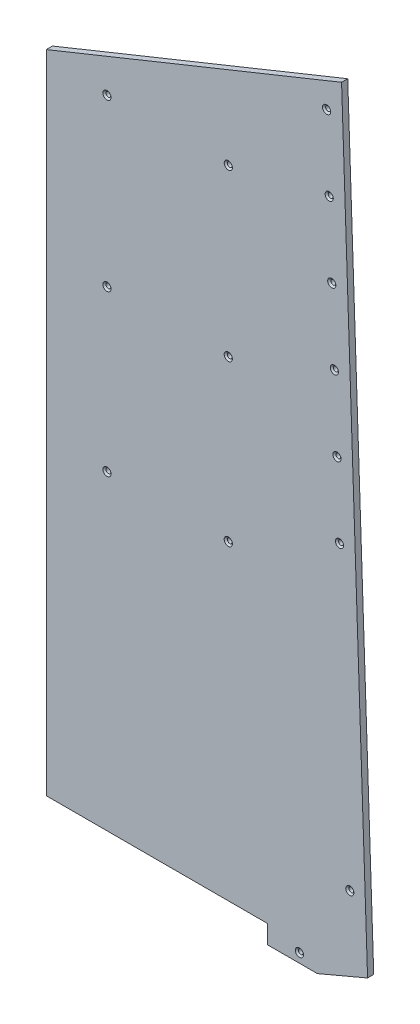
ISO-10303-21;
HEADER;
FILE_DESCRIPTION(('STEP AP214'),'2;1');
FILE_NAME('part.step','',(''),(''),'','','');
FILE_SCHEMA(('AUTOMOTIVE_DESIGN { 1 0 10303 214 1 1 1 1 }'));
ENDSEC;
DATA;
#1=APPLICATION_CONTEXT('core data for automotive mechanical design processes');
#2=APPLICATION_PROTOCOL_DEFINITION('international standard','automotive_design',2000,#1);
#3=PRODUCT_CONTEXT('',#1,'mechanical');
#4=PRODUCT('Part','Part','',(#3));
#5=PRODUCT_RELATED_PRODUCT_CATEGORY('part','',(#4));
#6=PRODUCT_DEFINITION_FORMATION('','',#4);
#7=PRODUCT_DEFINITION_CONTEXT('part definition',#1,'design');
#8=PRODUCT_DEFINITION('design','',#6,#7);
#9=PRODUCT_DEFINITION_SHAPE('','',#8);
#10=(LENGTH_UNIT() NAMED_UNIT(*) SI_UNIT(.MILLI.,.METRE.));
#11=(NAMED_UNIT(*) PLANE_ANGLE_UNIT() SI_UNIT($,.RADIAN.));
#12=(NAMED_UNIT(*) SI_UNIT($,.STERADIAN.) SOLID_ANGLE_UNIT());
#13=UNCERTAINTY_MEASURE_WITH_UNIT(LENGTH_MEASURE(1.E-05),#10,'distance_accuracy_value','');
#14=(GEOMETRIC_REPRESENTATION_CONTEXT(3) GLOBAL_UNCERTAINTY_ASSIGNED_CONTEXT((#13)) GLOBAL_UNIT_ASSIGNED_CONTEXT((#10,
#11,#12)) REPRESENTATION_CONTEXT('',''));
#15=CARTESIAN_POINT('',(0.,0.,0.));
#16=DIRECTION('',(0.,0.,1.));
#17=DIRECTION('',(1.,0.,0.));
#18=AXIS2_PLACEMENT_3D('',#15,#16,#17);
#19=CARTESIAN_POINT('',(0.,5955.03000000001,6.35));
#20=DIRECTION('',(0.,-1.,0.));
#21=DIRECTION('',(0.,0.,-1.));
#22=AXIS2_PLACEMENT_3D('',#19,#20,#21);
#23=PLANE('',#22);
#24=DIRECTION('',(-1.,0.,0.));
#25=VECTOR('',#24,1.);
#26=CARTESIAN_POINT('',(0.,5955.03000000001,0.));
#27=LINE('',#26,#25);
#28=CARTESIAN_POINT('',(2911.73000206494,5955.03000000001,0.));
#29=VERTEX_POINT('',#28);
#30=CARTESIAN_POINT('',(2683.51000001261,5955.03000000001,0.));
#31=VERTEX_POINT('',#30);
#32=EDGE_CURVE('E132',#29,#31,#27,.T.);
#33=ORIENTED_EDGE('',*,*,#32,.F.);
#34=DIRECTION('',(0.,0.,-1.));
#35=VECTOR('',#34,1.);
#36=CARTESIAN_POINT('',(2911.73000206494,5955.03000000001,6.35));
#37=LINE('',#36,#35);
#38=CARTESIAN_POINT('',(2911.73000206494,5955.03000000001,6.35));
#39=VERTEX_POINT('',#38);
#40=EDGE_CURVE('E11',#39,#29,#37,.T.);
#41=ORIENTED_EDGE('',*,*,#40,.F.);
#42=DIRECTION('',(-1.,0.,0.));
#43=VECTOR('',#42,1.);
#44=CARTESIAN_POINT('',(0.,5955.03000000001,6.35));
#45=LINE('',#44,#43);
#46=CARTESIAN_POINT('',(2683.51000001261,5955.03000000001,6.35));
#47=VERTEX_POINT('',#46);
#48=EDGE_CURVE('E150',#39,#47,#45,.T.);
#49=ORIENTED_EDGE('',*,*,#48,.T.);
#50=DIRECTION('',(0.,0.,-1.));
#51=VECTOR('',#50,1.);
#52=CARTESIAN_POINT('',(2683.51000001261,5955.03000000001,6.35));
#53=LINE('',#52,#51);
#54=EDGE_CURVE('E86',#47,#31,#53,.T.);
#55=ORIENTED_EDGE('',*,*,#54,.T.);
#56=EDGE_LOOP('',(#33,#41,#49,#55));
#57=FACE_BOUND('',#56,.T.);
#58=ADVANCED_FACE('F40',(#57),#23,.T.);
#59=CARTESIAN_POINT('',(2911.73000206494,0.,6.35));
#60=DIRECTION('',(1.,0.,0.));
#61=DIRECTION('',(0.,0.,-1.));
#62=AXIS2_PLACEMENT_3D('',#59,#60,#61);
#63=PLANE('',#62);
#64=DIRECTION('',(0.,-1.,0.));
#65=VECTOR('',#64,1.);
#66=CARTESIAN_POINT('',(2911.73000206494,0.,0.));
#67=LINE('',#66,#65);
#68=CARTESIAN_POINT('',(2911.73000206494,5935.98000018255,0.));
#69=VERTEX_POINT('',#68);
#70=EDGE_CURVE('E135',#29,#69,#67,.T.);
#71=ORIENTED_EDGE('',*,*,#70,.T.);
#72=DIRECTION('',(0.,0.,-1.));
#73=VECTOR('',#72,1.);
#74=CARTESIAN_POINT('',(2911.73000206494,5935.98000018255,6.35));
#75=LINE('',#74,#73);
#76=CARTESIAN_POINT('',(2911.73000206494,5935.98000018255,6.35));
#77=VERTEX_POINT('',#76);
#78=EDGE_CURVE('E48',#77,#69,#75,.T.);
#79=ORIENTED_EDGE('',*,*,#78,.F.);
#80=DIRECTION('',(0.,-1.,0.));
#81=VECTOR('',#80,1.);
#82=CARTESIAN_POINT('',(2911.73000206494,0.,6.35));
#83=LINE('',#82,#81);
#84=EDGE_CURVE('E186',#39,#77,#83,.T.);
#85=ORIENTED_EDGE('',*,*,#84,.F.);
#86=ORIENTED_EDGE('',*,*,#40,.T.);
#87=EDGE_LOOP('',(#71,#79,#85,#86));
#88=FACE_BOUND('',#87,.T.);
#89=ADVANCED_FACE('F162',(#88),#63,.F.);
#90=CARTESIAN_POINT('',(0.,5935.98000018255,6.35));
#91=DIRECTION('',(0.,-1.,0.));
#92=DIRECTION('',(0.,0.,-1.));
#93=AXIS2_PLACEMENT_3D('',#90,#91,#92);
#94=PLANE('',#93);
#95=DIRECTION('',(-1.,0.,0.));
#96=VECTOR('',#95,1.);
#97=CARTESIAN_POINT('',(0.,5935.98000018255,0.));
#98=LINE('',#97,#96);
#99=CARTESIAN_POINT('',(2962.99865857176,5935.98000018255,0.));
#100=VERTEX_POINT('',#99);
#101=EDGE_CURVE('E139',#100,#69,#98,.T.);
#102=ORIENTED_EDGE('',*,*,#101,.F.);
#103=DIRECTION('',(0.,0.,-1.));
#104=VECTOR('',#103,1.);
#105=CARTESIAN_POINT('',(2962.99865857176,5935.98000018255,6.35));
#106=LINE('',#105,#104);
#107=CARTESIAN_POINT('',(2962.99865857176,5935.98000018255,6.35));
#108=VERTEX_POINT('',#107);
#109=EDGE_CURVE('E113',#108,#100,#106,.T.);
#110=ORIENTED_EDGE('',*,*,#109,.F.);
#111=DIRECTION('',(-1.,0.,0.));
#112=VECTOR('',#111,1.);
#113=CARTESIAN_POINT('',(0.,5935.98000018255,6.35));
#114=LINE('',#113,#112);
#115=EDGE_CURVE('E121',#108,#77,#114,.T.);
#116=ORIENTED_EDGE('',*,*,#115,.T.);
#117=ORIENTED_EDGE('',*,*,#78,.T.);
#118=EDGE_LOOP('',(#102,#110,#116,#117));
#119=FACE_BOUND('',#118,.T.);
#120=ADVANCED_FACE('F159',(#119),#94,.T.);
#121=CARTESIAN_POINT('',(-1682.62991470468,3964.02766536305,6.35));
#122=DIRECTION('',(0.390731128489256,-0.920504853452448,0.));
#123=DIRECTION('',(0.920504853452448,0.390731128489256,0.));
#124=AXIS2_PLACEMENT_3D('',#121,#122,#123);
#125=PLANE('',#124);
#126=DIRECTION('',(-0.920504853452448,-0.390731128489256,0.));
#127=VECTOR('',#126,1.);
#128=CARTESIAN_POINT('',(-1682.62991470468,3964.02766536305,0.));
#129=LINE('',#128,#127);
#130=CARTESIAN_POINT('',(3014.72880420686,5957.9381442435,0.));
#131=VERTEX_POINT('',#130);
#132=EDGE_CURVE('E109',#131,#100,#129,.T.);
#133=ORIENTED_EDGE('',*,*,#132,.F.);
#134=DIRECTION('',(0.,0.,-1.));
#135=VECTOR('',#134,1.);
#136=CARTESIAN_POINT('',(3014.72880420686,5957.9381442435,6.35));
#137=LINE('',#136,#135);
#138=CARTESIAN_POINT('',(3014.72880420686,5957.9381442435,6.35));
#139=VERTEX_POINT('',#138);
#140=EDGE_CURVE('E104',#139,#131,#137,.T.);
#141=ORIENTED_EDGE('',*,*,#140,.F.);
#142=DIRECTION('',(-0.920504853452448,-0.390731128489256,0.));
#143=VECTOR('',#142,1.);
#144=CARTESIAN_POINT('',(-1682.62991470468,3964.02766536305,6.35));
#145=LINE('',#144,#143);
#146=EDGE_CURVE('E107',#139,#108,#145,.T.);
#147=ORIENTED_EDGE('',*,*,#146,.T.);
#148=ORIENTED_EDGE('',*,*,#109,.T.);
#149=EDGE_LOOP('',(#133,#141,#147,#148));
#150=FACE_BOUND('',#149,.T.);
#151=ADVANCED_FACE('F106',(#150),#125,.T.);
#152=CARTESIAN_POINT('',(3214.06687360478,109.549122522575,6.35));
#153=DIRECTION('',(0.999419636898833,0.0340644885622129,0.));
#154=DIRECTION('',(-0.0340644885622129,0.999419636898833,0.));
#155=AXIS2_PLACEMENT_3D('',#152,#153,#154);
#156=PLANE('',#155);
#157=DIRECTION('',(0.0340644885622129,-0.999419636898833,0.));
#158=VECTOR('',#157,1.);
#159=CARTESIAN_POINT('',(3214.06687360478,109.549122522575,0.));
#160=LINE('',#159,#158);
#161=CARTESIAN_POINT('',(2987.93000206494,6744.1894645031,0.));
#162=VERTEX_POINT('',#161);
#163=EDGE_CURVE('E143',#162,#131,#160,.T.);
#164=ORIENTED_EDGE('',*,*,#163,.F.);
#165=DIRECTION('',(0.,0.,-1.));
#166=VECTOR('',#165,1.);
#167=CARTESIAN_POINT('',(2987.93000206494,6744.1894645031,6.35));
#168=LINE('',#167,#166);
#169=CARTESIAN_POINT('',(2987.93000206494,6744.1894645031,6.35));
#170=VERTEX_POINT('',#169);
#171=EDGE_CURVE('E79',#170,#162,#168,.T.);
#172=ORIENTED_EDGE('',*,*,#171,.F.);
#173=DIRECTION('',(0.0340644885622129,-0.999419636898833,0.));
#174=VECTOR('',#173,1.);
#175=CARTESIAN_POINT('',(3214.06687360478,109.549122522575,6.35));
#176=LINE('',#175,#174);
#177=EDGE_CURVE('E119',#170,#139,#176,.T.);
#178=ORIENTED_EDGE('',*,*,#177,.T.);
#179=ORIENTED_EDGE('',*,*,#140,.T.);
#180=EDGE_LOOP('',(#164,#172,#178,#179));
#181=FACE_BOUND('',#180,.T.);
#182=ADVANCED_FACE('F123',(#181),#156,.T.);
#183=CARTESIAN_POINT('',(-1923.15731629717,4759.98139044679,6.35));
#184=DIRECTION('',(-0.374606593427528,0.927183854562094,0.));
#185=DIRECTION('',(-0.927183854562095,-0.374606593427528,0.));
#186=AXIS2_PLACEMENT_3D('',#183,#184,#185);
#187=PLANE('',#186);
#188=DIRECTION('',(0.927183854562094,0.374606593427528,0.));
#189=VECTOR('',#188,1.);
#190=CARTESIAN_POINT('',(-1923.15731629717,4759.98139044679,0.));
#191=LINE('',#190,#189);
#192=CARTESIAN_POINT('',(2683.51000001082,6621.19580000001,0.));
#193=VERTEX_POINT('',#192);
#194=EDGE_CURVE('E145',#193,#162,#191,.T.);
#195=ORIENTED_EDGE('',*,*,#194,.F.);
#196=DIRECTION('',(0.,0.,-1.));
#197=VECTOR('',#196,1.);
#198=CARTESIAN_POINT('',(2683.51000001082,6621.19580000001,6.35));
#199=LINE('',#198,#197);
#200=CARTESIAN_POINT('',(2683.51000001082,6621.19580000001,6.35));
#201=VERTEX_POINT('',#200);
#202=EDGE_CURVE('E152',#201,#193,#199,.T.);
#203=ORIENTED_EDGE('',*,*,#202,.F.);
#204=DIRECTION('',(0.927183854562094,0.374606593427528,0.));
#205=VECTOR('',#204,1.);
#206=CARTESIAN_POINT('',(-1923.15731629717,4759.98139044679,6.35));
#207=LINE('',#206,#205);
#208=EDGE_CURVE('E125',#201,#170,#207,.T.);
#209=ORIENTED_EDGE('',*,*,#208,.T.);
#210=ORIENTED_EDGE('',*,*,#171,.T.);
#211=EDGE_LOOP('',(#195,#203,#209,#210));
#212=FACE_BOUND('',#211,.T.);
#213=ADVANCED_FACE('F169',(#212),#187,.T.);
#214=CARTESIAN_POINT('',(2683.51000002859,7.20219501792756E-09,6.35));
#215=DIRECTION('',(1.,2.683871130665E-12,0.));
#216=DIRECTION('',(-2.683871130665E-12,1.,0.));
#217=AXIS2_PLACEMENT_3D('',#214,#215,#216);
#218=PLANE('',#217);
#219=DIRECTION('',(2.683871130665E-12,-1.,0.));
#220=VECTOR('',#219,1.);
#221=CARTESIAN_POINT('',(2683.51000002859,7.20219501792756E-09,0.));
#222=LINE('',#221,#220);
#223=CARTESIAN_POINT('',(2683.51000038598,6602.14580000002,0.));
#224=VERTEX_POINT('',#223);
#225=EDGE_CURVE('E148',#224,#31,#222,.T.);
#226=ORIENTED_EDGE('',*,*,#225,.T.);
#227=ORIENTED_EDGE('',*,*,#54,.F.);
#228=DIRECTION('',(2.683871130665E-12,-1.,0.));
#229=VECTOR('',#228,1.);
#230=CARTESIAN_POINT('',(2683.51000002859,7.20219501792756E-09,6.35));
#231=LINE('',#230,#229);
#232=CARTESIAN_POINT('',(2683.51000038598,6602.14580000002,6.35));
#233=VERTEX_POINT('',#232);
#234=EDGE_CURVE('E56',#233,#47,#231,.T.);
#235=ORIENTED_EDGE('',*,*,#234,.F.);
#236=DIRECTION('',(1.969333998879E-08,-1.,0.));
#237=VECTOR('',#236,1.);
#238=CARTESIAN_POINT('',(2683.51000001082,6621.19580000001,6.35));
#239=LINE('',#238,#237);
#240=EDGE_CURVE('E176',#201,#233,#239,.T.);
#241=ORIENTED_EDGE('',*,*,#240,.F.);
#242=ORIENTED_EDGE('',*,*,#202,.T.);
#243=DIRECTION('',(-1.96933399887901E-08,1.,0.));
#244=VECTOR('',#243,1.);
#245=CARTESIAN_POINT('',(2683.51000001082,6621.19580000001,0.));
#246=LINE('',#245,#244);
#247=EDGE_CURVE('E136',#224,#193,#246,.T.);
#248=ORIENTED_EDGE('',*,*,#247,.F.);
#249=EDGE_LOOP('',(#226,#227,#235,#241,#242,#248));
#250=FACE_BOUND('',#249,.T.);
#251=ADVANCED_FACE('F177',(#250),#218,.F.);
#252=CARTESIAN_POINT('',(0.,0.,6.35));
#253=DIRECTION('',(0.,0.,1.));
#254=DIRECTION('',(1.,0.,0.));
#255=AXIS2_PLACEMENT_3D('',#252,#253,#254);
#256=PLANE('',#255);
#257=CARTESIAN_POINT('',(2871.15080465522,6611.67080000002,6.35));
#258=DIRECTION('',(0.,0.,1.));
#259=DIRECTION('',(1.,0.,0.));
#260=AXIS2_PLACEMENT_3D('',#257,#258,#259);
#261=CIRCLE('',#260,4.21639999999979);
#262=CARTESIAN_POINT('',(2875.36720465522,6611.67080000002,6.35));
#263=VERTEX_POINT('',#262);
#264=EDGE_CURVE('E329',#263,#263,#261,.T.);
#265=ORIENTED_EDGE('',*,*,#264,.F.);
#266=EDGE_LOOP('',(#265));
#267=FACE_BOUND('',#266,.T.);
#268=CARTESIAN_POINT('',(2746.05693505903,6611.67080000002,6.35));
#269=DIRECTION('',(0.,0.,1.));
#270=DIRECTION('',(1.,0.,0.));
#271=AXIS2_PLACEMENT_3D('',#268,#269,#270);
#272=CIRCLE('',#271,4.21639999999979);
#273=CARTESIAN_POINT('',(2750.27333505903,6611.67080000002,6.35));
#274=VERTEX_POINT('',#273);
#275=EDGE_CURVE('E336',#274,#274,#272,.T.);
#276=ORIENTED_EDGE('',*,*,#275,.F.);
#277=EDGE_LOOP('',(#276));
#278=FACE_BOUND('',#277,.T.);
#279=CARTESIAN_POINT('',(2746.05693486333,6440.80500000001,6.35));
#280=DIRECTION('',(0.,0.,1.));
#281=DIRECTION('',(1.,0.,0.));
#282=AXIS2_PLACEMENT_3D('',#279,#280,#281);
#283=CIRCLE('',#282,4.21639999999979);
#284=CARTESIAN_POINT('',(2750.27333486333,6440.80500000001,6.35));
#285=VERTEX_POINT('',#284);
#286=EDGE_CURVE('E345',#285,#285,#283,.T.);
#287=ORIENTED_EDGE('',*,*,#286,.F.);
#288=EDGE_LOOP('',(#287));
#289=FACE_BOUND('',#288,.T.);
#290=CARTESIAN_POINT('',(2871.15080458999,6440.80500000001,6.35));
#291=DIRECTION('',(0.,0.,1.));
#292=DIRECTION('',(1.,0.,0.));
#293=AXIS2_PLACEMENT_3D('',#290,#291,#292);
#294=CIRCLE('',#293,4.21639999999979);
#295=CARTESIAN_POINT('',(2875.36720458999,6440.80500000001,6.35));
#296=VERTEX_POINT('',#295);
#297=EDGE_CURVE('E354',#296,#296,#294,.T.);
#298=ORIENTED_EDGE('',*,*,#297,.F.);
#299=EDGE_LOOP('',(#298));
#300=FACE_BOUND('',#299,.T.);
#301=CARTESIAN_POINT('',(2746.05693510027,6275.70500021418,6.35));
#302=DIRECTION('',(0.,0.,1.));
#303=DIRECTION('',(1.,0.,0.));
#304=AXIS2_PLACEMENT_3D('',#301,#302,#303);
#305=CIRCLE('',#304,4.21639999999979);
#306=CARTESIAN_POINT('',(2750.27333510027,6275.70500021418,6.35));
#307=VERTEX_POINT('',#306);
#308=EDGE_CURVE('E363',#307,#307,#305,.T.);
#309=ORIENTED_EDGE('',*,*,#308,.F.);
#310=EDGE_LOOP('',(#309));
#311=FACE_BOUND('',#310,.T.);
#312=CARTESIAN_POINT('',(2871.15080476319,6275.70500021417,6.35));
#313=DIRECTION('',(0.,0.,1.));
#314=DIRECTION('',(1.,0.,0.));
#315=AXIS2_PLACEMENT_3D('',#312,#313,#314);
#316=CIRCLE('',#315,4.21639999999979);
#317=CARTESIAN_POINT('',(2875.36720476319,6275.70500021417,6.35));
#318=VERTEX_POINT('',#317);
#319=EDGE_CURVE('E372',#318,#318,#316,.T.);
#320=ORIENTED_EDGE('',*,*,#319,.F.);
#321=EDGE_LOOP('',(#320));
#322=FACE_BOUND('',#321,.T.);
#323=CARTESIAN_POINT('',(2944.44621429083,5945.50500055575,6.35));
#324=DIRECTION('',(0.,0.,1.));
#325=DIRECTION('',(1.,0.,0.));
#326=AXIS2_PLACEMENT_3D('',#323,#324,#325);
#327=CIRCLE('',#326,4.21639999999979);
#328=CARTESIAN_POINT('',(2948.66261429083,5945.50500055575,6.35));
#329=VERTEX_POINT('',#328);
#330=EDGE_CURVE('E381',#329,#329,#327,.T.);
#331=ORIENTED_EDGE('',*,*,#330,.F.);
#332=EDGE_LOOP('',(#331));
#333=FACE_BOUND('',#332,.T.);
#334=CARTESIAN_POINT('',(2996.43958807611,6026.79520735138,6.35));
#335=DIRECTION('',(0.,0.,1.));
#336=DIRECTION('',(1.,0.,0.));
#337=AXIS2_PLACEMENT_3D('',#334,#335,#336);
#338=CIRCLE('',#337,4.21639999999979);
#339=CARTESIAN_POINT('',(3000.65598807611,6026.79520735138,6.35));
#340=VERTEX_POINT('',#339);
#341=EDGE_CURVE('E390',#340,#340,#338,.T.);
#342=ORIENTED_EDGE('',*,*,#341,.F.);
#343=EDGE_LOOP('',(#342));
#344=FACE_BOUND('',#343,.T.);
#345=CARTESIAN_POINT('',(2985.80222148104,6331.4095314268,6.35));
#346=DIRECTION('',(0.,0.,1.));
#347=DIRECTION('',(1.,0.,0.));
#348=AXIS2_PLACEMENT_3D('',#345,#346,#347);
#349=CIRCLE('',#348,4.21639999999979);
#350=CARTESIAN_POINT('',(2990.01862148104,6331.4095314268,6.35));
#351=VERTEX_POINT('',#350);
#352=EDGE_CURVE('E399',#351,#351,#349,.T.);
#353=ORIENTED_EDGE('',*,*,#352,.F.);
#354=EDGE_LOOP('',(#353));
#355=FACE_BOUND('',#354,.T.);
#356=CARTESIAN_POINT('',(2983.14287983227,6407.56311244565,6.35));
#357=DIRECTION('',(0.,0.,1.));
#358=DIRECTION('',(1.,0.,0.));
#359=AXIS2_PLACEMENT_3D('',#356,#357,#358);
#360=CIRCLE('',#359,4.21639999999979);
#361=CARTESIAN_POINT('',(2987.35927983227,6407.56311244565,6.35));
#362=VERTEX_POINT('',#361);
#363=EDGE_CURVE('E408',#362,#362,#360,.T.);
#364=ORIENTED_EDGE('',*,*,#363,.F.);
#365=EDGE_LOOP('',(#364));
#366=FACE_BOUND('',#365,.T.);
#367=CARTESIAN_POINT('',(2980.4835381835,6483.7166934645,6.35));
#368=DIRECTION('',(0.,0.,1.));
#369=DIRECTION('',(1.,0.,0.));
#370=AXIS2_PLACEMENT_3D('',#367,#368,#369);
#371=CIRCLE('',#370,4.21639999999979);
#372=CARTESIAN_POINT('',(2984.6999381835,6483.7166934645,6.35));
#373=VERTEX_POINT('',#372);
#374=EDGE_CURVE('E417',#373,#373,#371,.T.);
#375=ORIENTED_EDGE('',*,*,#374,.F.);
#376=EDGE_LOOP('',(#375));
#377=FACE_BOUND('',#376,.T.);
#378=CARTESIAN_POINT('',(2977.82419653474,6559.87027448336,6.35));
#379=DIRECTION('',(0.,0.,1.));
#380=DIRECTION('',(1.,0.,0.));
#381=AXIS2_PLACEMENT_3D('',#378,#379,#380);
#382=CIRCLE('',#381,4.21639999999979);
#383=CARTESIAN_POINT('',(2982.04059653473,6559.87027448336,6.35));
#384=VERTEX_POINT('',#383);
#385=EDGE_CURVE('E426',#384,#384,#382,.T.);
#386=ORIENTED_EDGE('',*,*,#385,.F.);
#387=EDGE_LOOP('',(#386));
#388=FACE_BOUND('',#387,.T.);
#389=CARTESIAN_POINT('',(2975.16485488597,6636.02385550221,6.35));
#390=DIRECTION('',(0.,0.,1.));
#391=DIRECTION('',(1.,0.,0.));
#392=AXIS2_PLACEMENT_3D('',#389,#390,#391);
#393=CIRCLE('',#392,4.21639999999979);
#394=CARTESIAN_POINT('',(2979.38125488597,6636.02385550221,6.35));
#395=VERTEX_POINT('',#394);
#396=EDGE_CURVE('E435',#395,#395,#393,.T.);
#397=ORIENTED_EDGE('',*,*,#396,.F.);
#398=EDGE_LOOP('',(#397));
#399=FACE_BOUND('',#398,.T.);
#400=CARTESIAN_POINT('',(2972.5055132372,6712.17743652106,6.35));
#401=DIRECTION('',(0.,0.,1.));
#402=DIRECTION('',(1.,0.,0.));
#403=AXIS2_PLACEMENT_3D('',#400,#401,#402);
#404=CIRCLE('',#403,4.21639999999979);
#405=CARTESIAN_POINT('',(2976.7219132372,6712.17743652106,6.35));
#406=VERTEX_POINT('',#405);
#407=EDGE_CURVE('E444',#406,#406,#404,.T.);
#408=ORIENTED_EDGE('',*,*,#407,.F.);
#409=EDGE_LOOP('',(#408));
#410=FACE_BOUND('',#409,.T.);
#411=ORIENTED_EDGE('',*,*,#208,.F.);
#412=ORIENTED_EDGE('',*,*,#240,.T.);
#413=ORIENTED_EDGE('',*,*,#234,.T.);
#414=ORIENTED_EDGE('',*,*,#48,.F.);
#415=ORIENTED_EDGE('',*,*,#84,.T.);
#416=ORIENTED_EDGE('',*,*,#115,.F.);
#417=ORIENTED_EDGE('',*,*,#146,.F.);
#418=ORIENTED_EDGE('',*,*,#177,.F.);
#419=EDGE_LOOP('',(#411,#412,#413,#414,#415,#416,#417,#418));
#420=FACE_BOUND('',#419,.T.);
#421=ADVANCED_FACE('F118',(#267,#278,#289,#300,#311,#322,#333,#344,#355,#366,#377,#388,#399,
#410,#420),#256,.T.);
#422=CARTESIAN_POINT('',(0.,0.,0.));
#423=DIRECTION('',(0.,0.,1.));
#424=DIRECTION('',(1.,0.,0.));
#425=AXIS2_PLACEMENT_3D('',#422,#423,#424);
#426=PLANE('',#425);
#427=CARTESIAN_POINT('',(2871.15080465522,6611.67080000002,0.));
#428=DIRECTION('',(0.,0.,1.));
#429=DIRECTION('',(1.,0.,0.));
#430=AXIS2_PLACEMENT_3D('',#427,#428,#429);
#431=CIRCLE('',#430,2.45745000000008);
#432=CARTESIAN_POINT('',(2873.60825465522,6611.67080000002,0.));
#433=VERTEX_POINT('',#432);
#434=EDGE_CURVE('E331',#433,#433,#431,.T.);
#435=ORIENTED_EDGE('',*,*,#434,.T.);
#436=EDGE_LOOP('',(#435));
#437=FACE_BOUND('',#436,.T.);
#438=CARTESIAN_POINT('',(2746.05693505903,6611.67080000002,0.));
#439=DIRECTION('',(0.,0.,1.));
#440=DIRECTION('',(1.,0.,0.));
#441=AXIS2_PLACEMENT_3D('',#438,#439,#440);
#442=CIRCLE('',#441,2.45745000000008);
#443=CARTESIAN_POINT('',(2748.51438505903,6611.67080000002,0.));
#444=VERTEX_POINT('',#443);
#445=EDGE_CURVE('E342',#444,#444,#442,.T.);
#446=ORIENTED_EDGE('',*,*,#445,.T.);
#447=EDGE_LOOP('',(#446));
#448=FACE_BOUND('',#447,.T.);
#449=CARTESIAN_POINT('',(2746.05693486333,6440.80500000001,0.));
#450=DIRECTION('',(0.,0.,1.));
#451=DIRECTION('',(1.,0.,0.));
#452=AXIS2_PLACEMENT_3D('',#449,#450,#451);
#453=CIRCLE('',#452,2.45745000000008);
#454=CARTESIAN_POINT('',(2748.51438486333,6440.80500000001,0.));
#455=VERTEX_POINT('',#454);
#456=EDGE_CURVE('E351',#455,#455,#453,.T.);
#457=ORIENTED_EDGE('',*,*,#456,.T.);
#458=EDGE_LOOP('',(#457));
#459=FACE_BOUND('',#458,.T.);
#460=CARTESIAN_POINT('',(2871.15080458999,6440.80500000001,0.));
#461=DIRECTION('',(0.,0.,1.));
#462=DIRECTION('',(1.,0.,0.));
#463=AXIS2_PLACEMENT_3D('',#460,#461,#462);
#464=CIRCLE('',#463,2.45745000000008);
#465=CARTESIAN_POINT('',(2873.60825458999,6440.80500000001,0.));
#466=VERTEX_POINT('',#465);
#467=EDGE_CURVE('E360',#466,#466,#464,.T.);
#468=ORIENTED_EDGE('',*,*,#467,.T.);
#469=EDGE_LOOP('',(#468));
#470=FACE_BOUND('',#469,.T.);
#471=CARTESIAN_POINT('',(2746.05693510027,6275.70500021418,0.));
#472=DIRECTION('',(0.,0.,1.));
#473=DIRECTION('',(1.,0.,0.));
#474=AXIS2_PLACEMENT_3D('',#471,#472,#473);
#475=CIRCLE('',#474,2.45745000000008);
#476=CARTESIAN_POINT('',(2748.51438510027,6275.70500021418,0.));
#477=VERTEX_POINT('',#476);
#478=EDGE_CURVE('E369',#477,#477,#475,.T.);
#479=ORIENTED_EDGE('',*,*,#478,.T.);
#480=EDGE_LOOP('',(#479));
#481=FACE_BOUND('',#480,.T.);
#482=CARTESIAN_POINT('',(2871.15080476319,6275.70500021417,0.));
#483=DIRECTION('',(0.,0.,1.));
#484=DIRECTION('',(1.,0.,0.));
#485=AXIS2_PLACEMENT_3D('',#482,#483,#484);
#486=CIRCLE('',#485,2.45745000000008);
#487=CARTESIAN_POINT('',(2873.60825476319,6275.70500021417,0.));
#488=VERTEX_POINT('',#487);
#489=EDGE_CURVE('E378',#488,#488,#486,.T.);
#490=ORIENTED_EDGE('',*,*,#489,.T.);
#491=EDGE_LOOP('',(#490));
#492=FACE_BOUND('',#491,.T.);
#493=CARTESIAN_POINT('',(2944.44621429083,5945.50500055575,0.));
#494=DIRECTION('',(0.,0.,1.));
#495=DIRECTION('',(1.,0.,0.));
#496=AXIS2_PLACEMENT_3D('',#493,#494,#495);
#497=CIRCLE('',#496,2.45745000000008);
#498=CARTESIAN_POINT('',(2946.90366429083,5945.50500055575,0.));
#499=VERTEX_POINT('',#498);
#500=EDGE_CURVE('E387',#499,#499,#497,.T.);
#501=ORIENTED_EDGE('',*,*,#500,.T.);
#502=EDGE_LOOP('',(#501));
#503=FACE_BOUND('',#502,.T.);
#504=CARTESIAN_POINT('',(2996.43958807611,6026.79520735138,0.));
#505=DIRECTION('',(0.,0.,1.));
#506=DIRECTION('',(1.,0.,0.));
#507=AXIS2_PLACEMENT_3D('',#504,#505,#506);
#508=CIRCLE('',#507,2.45745000000008);
#509=CARTESIAN_POINT('',(2998.89703807611,6026.79520735138,0.));
#510=VERTEX_POINT('',#509);
#511=EDGE_CURVE('E396',#510,#510,#508,.T.);
#512=ORIENTED_EDGE('',*,*,#511,.T.);
#513=EDGE_LOOP('',(#512));
#514=FACE_BOUND('',#513,.T.);
#515=CARTESIAN_POINT('',(2985.80222148104,6331.4095314268,0.));
#516=DIRECTION('',(0.,0.,1.));
#517=DIRECTION('',(1.,0.,0.));
#518=AXIS2_PLACEMENT_3D('',#515,#516,#517);
#519=CIRCLE('',#518,2.45745000000008);
#520=CARTESIAN_POINT('',(2988.25967148104,6331.4095314268,0.));
#521=VERTEX_POINT('',#520);
#522=EDGE_CURVE('E405',#521,#521,#519,.T.);
#523=ORIENTED_EDGE('',*,*,#522,.T.);
#524=EDGE_LOOP('',(#523));
#525=FACE_BOUND('',#524,.T.);
#526=CARTESIAN_POINT('',(2983.14287983227,6407.56311244565,0.));
#527=DIRECTION('',(0.,0.,1.));
#528=DIRECTION('',(1.,0.,0.));
#529=AXIS2_PLACEMENT_3D('',#526,#527,#528);
#530=CIRCLE('',#529,2.45745000000008);
#531=CARTESIAN_POINT('',(2985.60032983227,6407.56311244565,0.));
#532=VERTEX_POINT('',#531);
#533=EDGE_CURVE('E414',#532,#532,#530,.T.);
#534=ORIENTED_EDGE('',*,*,#533,.T.);
#535=EDGE_LOOP('',(#534));
#536=FACE_BOUND('',#535,.T.);
#537=CARTESIAN_POINT('',(2980.4835381835,6483.7166934645,0.));
#538=DIRECTION('',(0.,0.,1.));
#539=DIRECTION('',(1.,0.,0.));
#540=AXIS2_PLACEMENT_3D('',#537,#538,#539);
#541=CIRCLE('',#540,2.45745000000008);
#542=CARTESIAN_POINT('',(2982.9409881835,6483.7166934645,0.));
#543=VERTEX_POINT('',#542);
#544=EDGE_CURVE('E423',#543,#543,#541,.T.);
#545=ORIENTED_EDGE('',*,*,#544,.T.);
#546=EDGE_LOOP('',(#545));
#547=FACE_BOUND('',#546,.T.);
#548=CARTESIAN_POINT('',(2977.82419653474,6559.87027448336,0.));
#549=DIRECTION('',(0.,0.,1.));
#550=DIRECTION('',(1.,0.,0.));
#551=AXIS2_PLACEMENT_3D('',#548,#549,#550);
#552=CIRCLE('',#551,2.45745000000008);
#553=CARTESIAN_POINT('',(2980.28164653474,6559.87027448336,0.));
#554=VERTEX_POINT('',#553);
#555=EDGE_CURVE('E432',#554,#554,#552,.T.);
#556=ORIENTED_EDGE('',*,*,#555,.T.);
#557=EDGE_LOOP('',(#556));
#558=FACE_BOUND('',#557,.T.);
#559=CARTESIAN_POINT('',(2975.16485488597,6636.02385550221,0.));
#560=DIRECTION('',(0.,0.,1.));
#561=DIRECTION('',(1.,0.,0.));
#562=AXIS2_PLACEMENT_3D('',#559,#560,#561);
#563=CIRCLE('',#562,2.45745000000008);
#564=CARTESIAN_POINT('',(2977.62230488597,6636.02385550221,0.));
#565=VERTEX_POINT('',#564);
#566=EDGE_CURVE('E441',#565,#565,#563,.T.);
#567=ORIENTED_EDGE('',*,*,#566,.T.);
#568=EDGE_LOOP('',(#567));
#569=FACE_BOUND('',#568,.T.);
#570=CARTESIAN_POINT('',(2972.5055132372,6712.17743652106,0.));
#571=DIRECTION('',(0.,0.,1.));
#572=DIRECTION('',(1.,0.,0.));
#573=AXIS2_PLACEMENT_3D('',#570,#571,#572);
#574=CIRCLE('',#573,2.45745000000008);
#575=CARTESIAN_POINT('',(2974.9629632372,6712.17743652106,0.));
#576=VERTEX_POINT('',#575);
#577=EDGE_CURVE('E178',#576,#576,#574,.T.);
#578=ORIENTED_EDGE('',*,*,#577,.T.);
#579=EDGE_LOOP('',(#578));
#580=FACE_BOUND('',#579,.T.);
#581=ORIENTED_EDGE('',*,*,#247,.T.);
#582=ORIENTED_EDGE('',*,*,#194,.T.);
#583=ORIENTED_EDGE('',*,*,#163,.T.);
#584=ORIENTED_EDGE('',*,*,#132,.T.);
#585=ORIENTED_EDGE('',*,*,#101,.T.);
#586=ORIENTED_EDGE('',*,*,#70,.F.);
#587=ORIENTED_EDGE('',*,*,#32,.T.);
#588=ORIENTED_EDGE('',*,*,#225,.F.);
#589=EDGE_LOOP('',(#581,#582,#583,#584,#585,#586,#587,#588));
#590=FACE_BOUND('',#589,.T.);
#591=ADVANCED_FACE('F165',(#437,#448,#459,#470,#481,#492,#503,#514,#525,#536,#547,#558,#569,
#580,#590),#426,.F.);
#592=CARTESIAN_POINT('',(2972.5055132372,6712.17743652106,6.35));
#593=DIRECTION('',(0.,0.,1.));
#594=DIRECTION('',(1.,0.,0.));
#595=AXIS2_PLACEMENT_3D('',#592,#593,#594);
#596=CYLINDRICAL_SURFACE('',#595,2.45745000000008);
#597=ORIENTED_EDGE('',*,*,#577,.F.);
#598=EDGE_LOOP('',(#597));
#599=FACE_BOUND('',#598,.T.);
#600=CARTESIAN_POINT('',(2972.5055132372,6712.17743652106,4.87406570374072));
#601=DIRECTION('',(0.,0.,1.));
#602=DIRECTION('',(1.,0.,0.));
#603=AXIS2_PLACEMENT_3D('',#600,#601,#602);
#604=CIRCLE('',#603,2.45745000000008);
#605=CARTESIAN_POINT('',(2974.9629632372,6712.17743652106,4.87406570374072));
#606=VERTEX_POINT('',#605);
#607=EDGE_CURVE('E182',#606,#606,#604,.T.);
#608=ORIENTED_EDGE('',*,*,#607,.T.);
#609=EDGE_LOOP('',(#608));
#610=FACE_BOUND('',#609,.T.);
#611=ADVANCED_FACE('F206',(#599,#610),#596,.F.);
#612=CARTESIAN_POINT('',(2972.5055132372,6712.17743652106,6.35));
#613=DIRECTION('',(0.,0.,1.));
#614=DIRECTION('',(1.,0.,0.));
#615=AXIS2_PLACEMENT_3D('',#612,#613,#614);
#616=CONICAL_SURFACE('',#615,4.21639999999979,0.872664625997081);
#617=ORIENTED_EDGE('',*,*,#607,.F.);
#618=EDGE_LOOP('',(#617));
#619=FACE_BOUND('',#618,.T.);
#620=ORIENTED_EDGE('',*,*,#407,.T.);
#621=EDGE_LOOP('',(#620));
#622=FACE_BOUND('',#621,.T.);
#623=ADVANCED_FACE('F213',(#619,#622),#616,.F.);
#624=CARTESIAN_POINT('',(2975.16485488597,6636.02385550221,6.35));
#625=DIRECTION('',(0.,0.,1.));
#626=DIRECTION('',(1.,0.,0.));
#627=AXIS2_PLACEMENT_3D('',#624,#625,#626);
#628=CYLINDRICAL_SURFACE('',#627,2.45745000000008);
#629=ORIENTED_EDGE('',*,*,#566,.F.);
#630=EDGE_LOOP('',(#629));
#631=FACE_BOUND('',#630,.T.);
#632=CARTESIAN_POINT('',(2975.16485488597,6636.02385550221,4.87406570374072));
#633=DIRECTION('',(0.,0.,1.));
#634=DIRECTION('',(1.,0.,0.));
#635=AXIS2_PLACEMENT_3D('',#632,#633,#634);
#636=CIRCLE('',#635,2.45745000000008);
#637=CARTESIAN_POINT('',(2977.62230488597,6636.02385550221,4.87406570374072));
#638=VERTEX_POINT('',#637);
#639=EDGE_CURVE('E438',#638,#638,#636,.T.);
#640=ORIENTED_EDGE('',*,*,#639,.T.);
#641=EDGE_LOOP('',(#640));
#642=FACE_BOUND('',#641,.T.);
#643=ADVANCED_FACE('F217',(#631,#642),#628,.F.);
#644=CARTESIAN_POINT('',(2975.16485488597,6636.02385550221,6.35));
#645=DIRECTION('',(0.,0.,1.));
#646=DIRECTION('',(1.,0.,0.));
#647=AXIS2_PLACEMENT_3D('',#644,#645,#646);
#648=CONICAL_SURFACE('',#647,4.21639999999979,0.872664625997081);
#649=ORIENTED_EDGE('',*,*,#639,.F.);
#650=EDGE_LOOP('',(#649));
#651=FACE_BOUND('',#650,.T.);
#652=ORIENTED_EDGE('',*,*,#396,.T.);
#653=EDGE_LOOP('',(#652));
#654=FACE_BOUND('',#653,.T.);
#655=ADVANCED_FACE('F221',(#651,#654),#648,.F.);
#656=CARTESIAN_POINT('',(2977.82419653474,6559.87027448336,6.35));
#657=DIRECTION('',(0.,0.,1.));
#658=DIRECTION('',(1.,0.,0.));
#659=AXIS2_PLACEMENT_3D('',#656,#657,#658);
#660=CYLINDRICAL_SURFACE('',#659,2.45745000000008);
#661=ORIENTED_EDGE('',*,*,#555,.F.);
#662=EDGE_LOOP('',(#661));
#663=FACE_BOUND('',#662,.T.);
#664=CARTESIAN_POINT('',(2977.82419653474,6559.87027448336,4.87406570374072));
#665=DIRECTION('',(0.,0.,1.));
#666=DIRECTION('',(1.,0.,0.));
#667=AXIS2_PLACEMENT_3D('',#664,#665,#666);
#668=CIRCLE('',#667,2.45745000000008);
#669=CARTESIAN_POINT('',(2980.28164653474,6559.87027448336,4.87406570374072));
#670=VERTEX_POINT('',#669);
#671=EDGE_CURVE('E429',#670,#670,#668,.T.);
#672=ORIENTED_EDGE('',*,*,#671,.T.);
#673=EDGE_LOOP('',(#672));
#674=FACE_BOUND('',#673,.T.);
#675=ADVANCED_FACE('F225',(#663,#674),#660,.F.);
#676=CARTESIAN_POINT('',(2977.82419653474,6559.87027448336,6.35));
#677=DIRECTION('',(0.,0.,1.));
#678=DIRECTION('',(1.,0.,0.));
#679=AXIS2_PLACEMENT_3D('',#676,#677,#678);
#680=CONICAL_SURFACE('',#679,4.21639999999979,0.872664625997081);
#681=ORIENTED_EDGE('',*,*,#671,.F.);
#682=EDGE_LOOP('',(#681));
#683=FACE_BOUND('',#682,.T.);
#684=ORIENTED_EDGE('',*,*,#385,.T.);
#685=EDGE_LOOP('',(#684));
#686=FACE_BOUND('',#685,.T.);
#687=ADVANCED_FACE('F229',(#683,#686),#680,.F.);
#688=CARTESIAN_POINT('',(2980.4835381835,6483.7166934645,6.35));
#689=DIRECTION('',(0.,0.,1.));
#690=DIRECTION('',(1.,0.,0.));
#691=AXIS2_PLACEMENT_3D('',#688,#689,#690);
#692=CYLINDRICAL_SURFACE('',#691,2.45745000000008);
#693=ORIENTED_EDGE('',*,*,#544,.F.);
#694=EDGE_LOOP('',(#693));
#695=FACE_BOUND('',#694,.T.);
#696=CARTESIAN_POINT('',(2980.4835381835,6483.7166934645,4.87406570374072));
#697=DIRECTION('',(0.,0.,1.));
#698=DIRECTION('',(1.,0.,0.));
#699=AXIS2_PLACEMENT_3D('',#696,#697,#698);
#700=CIRCLE('',#699,2.45745000000008);
#701=CARTESIAN_POINT('',(2982.9409881835,6483.7166934645,4.87406570374072));
#702=VERTEX_POINT('',#701);
#703=EDGE_CURVE('E420',#702,#702,#700,.T.);
#704=ORIENTED_EDGE('',*,*,#703,.T.);
#705=EDGE_LOOP('',(#704));
#706=FACE_BOUND('',#705,.T.);
#707=ADVANCED_FACE('F233',(#695,#706),#692,.F.);
#708=CARTESIAN_POINT('',(2980.4835381835,6483.7166934645,6.35));
#709=DIRECTION('',(0.,0.,1.));
#710=DIRECTION('',(1.,0.,0.));
#711=AXIS2_PLACEMENT_3D('',#708,#709,#710);
#712=CONICAL_SURFACE('',#711,4.21639999999979,0.872664625997081);
#713=ORIENTED_EDGE('',*,*,#703,.F.);
#714=EDGE_LOOP('',(#713));
#715=FACE_BOUND('',#714,.T.);
#716=ORIENTED_EDGE('',*,*,#374,.T.);
#717=EDGE_LOOP('',(#716));
#718=FACE_BOUND('',#717,.T.);
#719=ADVANCED_FACE('F237',(#715,#718),#712,.F.);
#720=CARTESIAN_POINT('',(2983.14287983227,6407.56311244565,6.35));
#721=DIRECTION('',(0.,0.,1.));
#722=DIRECTION('',(1.,0.,0.));
#723=AXIS2_PLACEMENT_3D('',#720,#721,#722);
#724=CYLINDRICAL_SURFACE('',#723,2.45745000000008);
#725=ORIENTED_EDGE('',*,*,#533,.F.);
#726=EDGE_LOOP('',(#725));
#727=FACE_BOUND('',#726,.T.);
#728=CARTESIAN_POINT('',(2983.14287983227,6407.56311244565,4.87406570374072));
#729=DIRECTION('',(0.,0.,1.));
#730=DIRECTION('',(1.,0.,0.));
#731=AXIS2_PLACEMENT_3D('',#728,#729,#730);
#732=CIRCLE('',#731,2.45745000000008);
#733=CARTESIAN_POINT('',(2985.60032983227,6407.56311244565,4.87406570374072));
#734=VERTEX_POINT('',#733);
#735=EDGE_CURVE('E411',#734,#734,#732,.T.);
#736=ORIENTED_EDGE('',*,*,#735,.T.);
#737=EDGE_LOOP('',(#736));
#738=FACE_BOUND('',#737,.T.);
#739=ADVANCED_FACE('F241',(#727,#738),#724,.F.);
#740=CARTESIAN_POINT('',(2983.14287983227,6407.56311244565,6.35));
#741=DIRECTION('',(0.,0.,1.));
#742=DIRECTION('',(1.,0.,0.));
#743=AXIS2_PLACEMENT_3D('',#740,#741,#742);
#744=CONICAL_SURFACE('',#743,4.21639999999979,0.872664625997081);
#745=ORIENTED_EDGE('',*,*,#735,.F.);
#746=EDGE_LOOP('',(#745));
#747=FACE_BOUND('',#746,.T.);
#748=ORIENTED_EDGE('',*,*,#363,.T.);
#749=EDGE_LOOP('',(#748));
#750=FACE_BOUND('',#749,.T.);
#751=ADVANCED_FACE('F245',(#747,#750),#744,.F.);
#752=CARTESIAN_POINT('',(2985.80222148104,6331.4095314268,6.35));
#753=DIRECTION('',(0.,0.,1.));
#754=DIRECTION('',(1.,0.,0.));
#755=AXIS2_PLACEMENT_3D('',#752,#753,#754);
#756=CYLINDRICAL_SURFACE('',#755,2.45745000000008);
#757=ORIENTED_EDGE('',*,*,#522,.F.);
#758=EDGE_LOOP('',(#757));
#759=FACE_BOUND('',#758,.T.);
#760=CARTESIAN_POINT('',(2985.80222148104,6331.4095314268,4.87406570374072));
#761=DIRECTION('',(0.,0.,1.));
#762=DIRECTION('',(1.,0.,0.));
#763=AXIS2_PLACEMENT_3D('',#760,#761,#762);
#764=CIRCLE('',#763,2.45745000000008);
#765=CARTESIAN_POINT('',(2988.25967148104,6331.4095314268,4.87406570374072));
#766=VERTEX_POINT('',#765);
#767=EDGE_CURVE('E402',#766,#766,#764,.T.);
#768=ORIENTED_EDGE('',*,*,#767,.T.);
#769=EDGE_LOOP('',(#768));
#770=FACE_BOUND('',#769,.T.);
#771=ADVANCED_FACE('F249',(#759,#770),#756,.F.);
#772=CARTESIAN_POINT('',(2985.80222148104,6331.4095314268,6.35));
#773=DIRECTION('',(0.,0.,1.));
#774=DIRECTION('',(1.,0.,0.));
#775=AXIS2_PLACEMENT_3D('',#772,#773,#774);
#776=CONICAL_SURFACE('',#775,4.21639999999979,0.872664625997081);
#777=ORIENTED_EDGE('',*,*,#767,.F.);
#778=EDGE_LOOP('',(#777));
#779=FACE_BOUND('',#778,.T.);
#780=ORIENTED_EDGE('',*,*,#352,.T.);
#781=EDGE_LOOP('',(#780));
#782=FACE_BOUND('',#781,.T.);
#783=ADVANCED_FACE('F253',(#779,#782),#776,.F.);
#784=CARTESIAN_POINT('',(2996.43958807611,6026.79520735138,6.35));
#785=DIRECTION('',(0.,0.,1.));
#786=DIRECTION('',(1.,0.,0.));
#787=AXIS2_PLACEMENT_3D('',#784,#785,#786);
#788=CYLINDRICAL_SURFACE('',#787,2.45745000000008);
#789=ORIENTED_EDGE('',*,*,#511,.F.);
#790=EDGE_LOOP('',(#789));
#791=FACE_BOUND('',#790,.T.);
#792=CARTESIAN_POINT('',(2996.43958807611,6026.79520735138,4.87406570374072));
#793=DIRECTION('',(0.,0.,1.));
#794=DIRECTION('',(1.,0.,0.));
#795=AXIS2_PLACEMENT_3D('',#792,#793,#794);
#796=CIRCLE('',#795,2.45745000000008);
#797=CARTESIAN_POINT('',(2998.89703807611,6026.79520735138,4.87406570374072));
#798=VERTEX_POINT('',#797);
#799=EDGE_CURVE('E393',#798,#798,#796,.T.);
#800=ORIENTED_EDGE('',*,*,#799,.T.);
#801=EDGE_LOOP('',(#800));
#802=FACE_BOUND('',#801,.T.);
#803=ADVANCED_FACE('F257',(#791,#802),#788,.F.);
#804=CARTESIAN_POINT('',(2996.43958807611,6026.79520735138,6.35));
#805=DIRECTION('',(0.,0.,1.));
#806=DIRECTION('',(1.,0.,0.));
#807=AXIS2_PLACEMENT_3D('',#804,#805,#806);
#808=CONICAL_SURFACE('',#807,4.21639999999979,0.872664625997081);
#809=ORIENTED_EDGE('',*,*,#799,.F.);
#810=EDGE_LOOP('',(#809));
#811=FACE_BOUND('',#810,.T.);
#812=ORIENTED_EDGE('',*,*,#341,.T.);
#813=EDGE_LOOP('',(#812));
#814=FACE_BOUND('',#813,.T.);
#815=ADVANCED_FACE('F261',(#811,#814),#808,.F.);
#816=CARTESIAN_POINT('',(2944.44621429083,5945.50500055575,6.35));
#817=DIRECTION('',(0.,0.,1.));
#818=DIRECTION('',(1.,0.,0.));
#819=AXIS2_PLACEMENT_3D('',#816,#817,#818);
#820=CYLINDRICAL_SURFACE('',#819,2.45745000000008);
#821=ORIENTED_EDGE('',*,*,#500,.F.);
#822=EDGE_LOOP('',(#821));
#823=FACE_BOUND('',#822,.T.);
#824=CARTESIAN_POINT('',(2944.44621429083,5945.50500055575,4.87406570374072));
#825=DIRECTION('',(0.,0.,1.));
#826=DIRECTION('',(1.,0.,0.));
#827=AXIS2_PLACEMENT_3D('',#824,#825,#826);
#828=CIRCLE('',#827,2.45745000000008);
#829=CARTESIAN_POINT('',(2946.90366429083,5945.50500055575,4.87406570374072));
#830=VERTEX_POINT('',#829);
#831=EDGE_CURVE('E384',#830,#830,#828,.T.);
#832=ORIENTED_EDGE('',*,*,#831,.T.);
#833=EDGE_LOOP('',(#832));
#834=FACE_BOUND('',#833,.T.);
#835=ADVANCED_FACE('F265',(#823,#834),#820,.F.);
#836=CARTESIAN_POINT('',(2944.44621429083,5945.50500055575,6.35));
#837=DIRECTION('',(0.,0.,1.));
#838=DIRECTION('',(1.,0.,0.));
#839=AXIS2_PLACEMENT_3D('',#836,#837,#838);
#840=CONICAL_SURFACE('',#839,4.21639999999979,0.872664625997081);
#841=ORIENTED_EDGE('',*,*,#831,.F.);
#842=EDGE_LOOP('',(#841));
#843=FACE_BOUND('',#842,.T.);
#844=ORIENTED_EDGE('',*,*,#330,.T.);
#845=EDGE_LOOP('',(#844));
#846=FACE_BOUND('',#845,.T.);
#847=ADVANCED_FACE('F269',(#843,#846),#840,.F.);
#848=CARTESIAN_POINT('',(2871.15080476319,6275.70500021417,6.35));
#849=DIRECTION('',(0.,0.,1.));
#850=DIRECTION('',(1.,0.,0.));
#851=AXIS2_PLACEMENT_3D('',#848,#849,#850);
#852=CYLINDRICAL_SURFACE('',#851,2.45745000000008);
#853=ORIENTED_EDGE('',*,*,#489,.F.);
#854=EDGE_LOOP('',(#853));
#855=FACE_BOUND('',#854,.T.);
#856=CARTESIAN_POINT('',(2871.15080476319,6275.70500021417,4.87406570374072));
#857=DIRECTION('',(0.,0.,1.));
#858=DIRECTION('',(1.,0.,0.));
#859=AXIS2_PLACEMENT_3D('',#856,#857,#858);
#860=CIRCLE('',#859,2.45745000000008);
#861=CARTESIAN_POINT('',(2873.60825476319,6275.70500021417,4.87406570374072));
#862=VERTEX_POINT('',#861);
#863=EDGE_CURVE('E375',#862,#862,#860,.T.);
#864=ORIENTED_EDGE('',*,*,#863,.T.);
#865=EDGE_LOOP('',(#864));
#866=FACE_BOUND('',#865,.T.);
#867=ADVANCED_FACE('F273',(#855,#866),#852,.F.);
#868=CARTESIAN_POINT('',(2871.15080476319,6275.70500021417,6.35));
#869=DIRECTION('',(0.,0.,1.));
#870=DIRECTION('',(1.,0.,0.));
#871=AXIS2_PLACEMENT_3D('',#868,#869,#870);
#872=CONICAL_SURFACE('',#871,4.21639999999979,0.872664625997081);
#873=ORIENTED_EDGE('',*,*,#863,.F.);
#874=EDGE_LOOP('',(#873));
#875=FACE_BOUND('',#874,.T.);
#876=ORIENTED_EDGE('',*,*,#319,.T.);
#877=EDGE_LOOP('',(#876));
#878=FACE_BOUND('',#877,.T.);
#879=ADVANCED_FACE('F277',(#875,#878),#872,.F.);
#880=CARTESIAN_POINT('',(2746.05693510027,6275.70500021418,6.35));
#881=DIRECTION('',(0.,0.,1.));
#882=DIRECTION('',(1.,0.,0.));
#883=AXIS2_PLACEMENT_3D('',#880,#881,#882);
#884=CYLINDRICAL_SURFACE('',#883,2.45745000000008);
#885=ORIENTED_EDGE('',*,*,#478,.F.);
#886=EDGE_LOOP('',(#885));
#887=FACE_BOUND('',#886,.T.);
#888=CARTESIAN_POINT('',(2746.05693510027,6275.70500021418,4.87406570374072));
#889=DIRECTION('',(0.,0.,1.));
#890=DIRECTION('',(1.,0.,0.));
#891=AXIS2_PLACEMENT_3D('',#888,#889,#890);
#892=CIRCLE('',#891,2.45745000000008);
#893=CARTESIAN_POINT('',(2748.51438510027,6275.70500021418,4.87406570374072));
#894=VERTEX_POINT('',#893);
#895=EDGE_CURVE('E366',#894,#894,#892,.T.);
#896=ORIENTED_EDGE('',*,*,#895,.T.);
#897=EDGE_LOOP('',(#896));
#898=FACE_BOUND('',#897,.T.);
#899=ADVANCED_FACE('F281',(#887,#898),#884,.F.);
#900=CARTESIAN_POINT('',(2746.05693510027,6275.70500021418,6.35));
#901=DIRECTION('',(0.,0.,1.));
#902=DIRECTION('',(1.,0.,0.));
#903=AXIS2_PLACEMENT_3D('',#900,#901,#902);
#904=CONICAL_SURFACE('',#903,4.21639999999979,0.872664625997081);
#905=ORIENTED_EDGE('',*,*,#895,.F.);
#906=EDGE_LOOP('',(#905));
#907=FACE_BOUND('',#906,.T.);
#908=ORIENTED_EDGE('',*,*,#308,.T.);
#909=EDGE_LOOP('',(#908));
#910=FACE_BOUND('',#909,.T.);
#911=ADVANCED_FACE('F285',(#907,#910),#904,.F.);
#912=CARTESIAN_POINT('',(2871.15080458999,6440.80500000001,6.35));
#913=DIRECTION('',(0.,0.,1.));
#914=DIRECTION('',(1.,0.,0.));
#915=AXIS2_PLACEMENT_3D('',#912,#913,#914);
#916=CYLINDRICAL_SURFACE('',#915,2.45745000000008);
#917=ORIENTED_EDGE('',*,*,#467,.F.);
#918=EDGE_LOOP('',(#917));
#919=FACE_BOUND('',#918,.T.);
#920=CARTESIAN_POINT('',(2871.15080458999,6440.80500000001,4.87406570374072));
#921=DIRECTION('',(0.,0.,1.));
#922=DIRECTION('',(1.,0.,0.));
#923=AXIS2_PLACEMENT_3D('',#920,#921,#922);
#924=CIRCLE('',#923,2.45745000000008);
#925=CARTESIAN_POINT('',(2873.60825458999,6440.80500000001,4.87406570374072));
#926=VERTEX_POINT('',#925);
#927=EDGE_CURVE('E357',#926,#926,#924,.T.);
#928=ORIENTED_EDGE('',*,*,#927,.T.);
#929=EDGE_LOOP('',(#928));
#930=FACE_BOUND('',#929,.T.);
#931=ADVANCED_FACE('F289',(#919,#930),#916,.F.);
#932=CARTESIAN_POINT('',(2871.15080458999,6440.80500000001,6.35));
#933=DIRECTION('',(0.,0.,1.));
#934=DIRECTION('',(1.,0.,0.));
#935=AXIS2_PLACEMENT_3D('',#932,#933,#934);
#936=CONICAL_SURFACE('',#935,4.21639999999979,0.872664625997081);
#937=ORIENTED_EDGE('',*,*,#927,.F.);
#938=EDGE_LOOP('',(#937));
#939=FACE_BOUND('',#938,.T.);
#940=ORIENTED_EDGE('',*,*,#297,.T.);
#941=EDGE_LOOP('',(#940));
#942=FACE_BOUND('',#941,.T.);
#943=ADVANCED_FACE('F293',(#939,#942),#936,.F.);
#944=CARTESIAN_POINT('',(2746.05693486333,6440.80500000001,6.35));
#945=DIRECTION('',(0.,0.,1.));
#946=DIRECTION('',(1.,0.,0.));
#947=AXIS2_PLACEMENT_3D('',#944,#945,#946);
#948=CYLINDRICAL_SURFACE('',#947,2.45745000000008);
#949=ORIENTED_EDGE('',*,*,#456,.F.);
#950=EDGE_LOOP('',(#949));
#951=FACE_BOUND('',#950,.T.);
#952=CARTESIAN_POINT('',(2746.05693486333,6440.80500000001,4.87406570374072));
#953=DIRECTION('',(0.,0.,1.));
#954=DIRECTION('',(1.,0.,0.));
#955=AXIS2_PLACEMENT_3D('',#952,#953,#954);
#956=CIRCLE('',#955,2.45745000000008);
#957=CARTESIAN_POINT('',(2748.51438486333,6440.80500000001,4.87406570374072));
#958=VERTEX_POINT('',#957);
#959=EDGE_CURVE('E348',#958,#958,#956,.T.);
#960=ORIENTED_EDGE('',*,*,#959,.T.);
#961=EDGE_LOOP('',(#960));
#962=FACE_BOUND('',#961,.T.);
#963=ADVANCED_FACE('F297',(#951,#962),#948,.F.);
#964=CARTESIAN_POINT('',(2746.05693486333,6440.80500000001,6.35));
#965=DIRECTION('',(0.,0.,1.));
#966=DIRECTION('',(1.,0.,0.));
#967=AXIS2_PLACEMENT_3D('',#964,#965,#966);
#968=CONICAL_SURFACE('',#967,4.21639999999979,0.872664625997081);
#969=ORIENTED_EDGE('',*,*,#959,.F.);
#970=EDGE_LOOP('',(#969));
#971=FACE_BOUND('',#970,.T.);
#972=ORIENTED_EDGE('',*,*,#286,.T.);
#973=EDGE_LOOP('',(#972));
#974=FACE_BOUND('',#973,.T.);
#975=ADVANCED_FACE('F301',(#971,#974),#968,.F.);
#976=CARTESIAN_POINT('',(2746.05693505903,6611.67080000002,6.35));
#977=DIRECTION('',(0.,0.,1.));
#978=DIRECTION('',(1.,0.,0.));
#979=AXIS2_PLACEMENT_3D('',#976,#977,#978);
#980=CYLINDRICAL_SURFACE('',#979,2.45745000000008);
#981=ORIENTED_EDGE('',*,*,#445,.F.);
#982=EDGE_LOOP('',(#981));
#983=FACE_BOUND('',#982,.T.);
#984=CARTESIAN_POINT('',(2746.05693505903,6611.67080000002,4.87406570374072));
#985=DIRECTION('',(0.,0.,1.));
#986=DIRECTION('',(1.,0.,0.));
#987=AXIS2_PLACEMENT_3D('',#984,#985,#986);
#988=CIRCLE('',#987,2.45745000000008);
#989=CARTESIAN_POINT('',(2748.51438505903,6611.67080000002,4.87406570374072));
#990=VERTEX_POINT('',#989);
#991=EDGE_CURVE('E339',#990,#990,#988,.T.);
#992=ORIENTED_EDGE('',*,*,#991,.T.);
#993=EDGE_LOOP('',(#992));
#994=FACE_BOUND('',#993,.T.);
#995=ADVANCED_FACE('F305',(#983,#994),#980,.F.);
#996=CARTESIAN_POINT('',(2746.05693505903,6611.67080000002,6.35));
#997=DIRECTION('',(0.,0.,1.));
#998=DIRECTION('',(1.,0.,0.));
#999=AXIS2_PLACEMENT_3D('',#996,#997,#998);
#1000=CONICAL_SURFACE('',#999,4.21639999999979,0.872664625997081);
#1001=ORIENTED_EDGE('',*,*,#991,.F.);
#1002=EDGE_LOOP('',(#1001));
#1003=FACE_BOUND('',#1002,.T.);
#1004=ORIENTED_EDGE('',*,*,#275,.T.);
#1005=EDGE_LOOP('',(#1004));
#1006=FACE_BOUND('',#1005,.T.);
#1007=ADVANCED_FACE('F309',(#1003,#1006),#1000,.F.);
#1008=CARTESIAN_POINT('',(2871.15080465522,6611.67080000002,6.35));
#1009=DIRECTION('',(0.,0.,1.));
#1010=DIRECTION('',(1.,0.,0.));
#1011=AXIS2_PLACEMENT_3D('',#1008,#1009,#1010);
#1012=CYLINDRICAL_SURFACE('',#1011,2.45745000000008);
#1013=ORIENTED_EDGE('',*,*,#434,.F.);
#1014=EDGE_LOOP('',(#1013));
#1015=FACE_BOUND('',#1014,.T.);
#1016=CARTESIAN_POINT('',(2871.15080465522,6611.67080000002,4.87406570374072));
#1017=DIRECTION('',(0.,0.,1.));
#1018=DIRECTION('',(1.,0.,0.));
#1019=AXIS2_PLACEMENT_3D('',#1016,#1017,#1018);
#1020=CIRCLE('',#1019,2.45745000000008);
#1021=CARTESIAN_POINT('',(2873.60825465522,6611.67080000002,4.87406570374072));
#1022=VERTEX_POINT('',#1021);
#1023=EDGE_CURVE('E326',#1022,#1022,#1020,.T.);
#1024=ORIENTED_EDGE('',*,*,#1023,.T.);
#1025=EDGE_LOOP('',(#1024));
#1026=FACE_BOUND('',#1025,.T.);
#1027=ADVANCED_FACE('F313',(#1015,#1026),#1012,.F.);
#1028=CARTESIAN_POINT('',(2871.15080465522,6611.67080000002,6.35));
#1029=DIRECTION('',(0.,0.,1.));
#1030=DIRECTION('',(1.,0.,0.));
#1031=AXIS2_PLACEMENT_3D('',#1028,#1029,#1030);
#1032=CONICAL_SURFACE('',#1031,4.21639999999979,0.872664625997081);
#1033=ORIENTED_EDGE('',*,*,#1023,.F.);
#1034=EDGE_LOOP('',(#1033));
#1035=FACE_BOUND('',#1034,.T.);
#1036=ORIENTED_EDGE('',*,*,#264,.T.);
#1037=EDGE_LOOP('',(#1036));
#1038=FACE_BOUND('',#1037,.T.);
#1039=ADVANCED_FACE('F317',(#1035,#1038),#1032,.F.);
#1040=CLOSED_SHELL('',(#58,#89,#120,#151,#182,#213,#251,#421,#591,#611,#623,#643,#655,#675,#687,
#707,#719,#739,#751,#771,#783,#803,#815,#835,#847,#867,#879,#899,#911,#931,#943,#963,#975,#995,
#1007,#1027,#1039));
#1041=MANIFOLD_SOLID_BREP('B2',#1040);
#1042=ADVANCED_BREP_SHAPE_REPRESENTATION('',(#18,#1041),#14);
#1043=SHAPE_DEFINITION_REPRESENTATION(#9,#1042);
ENDSEC;
END-ISO-10303-21;
